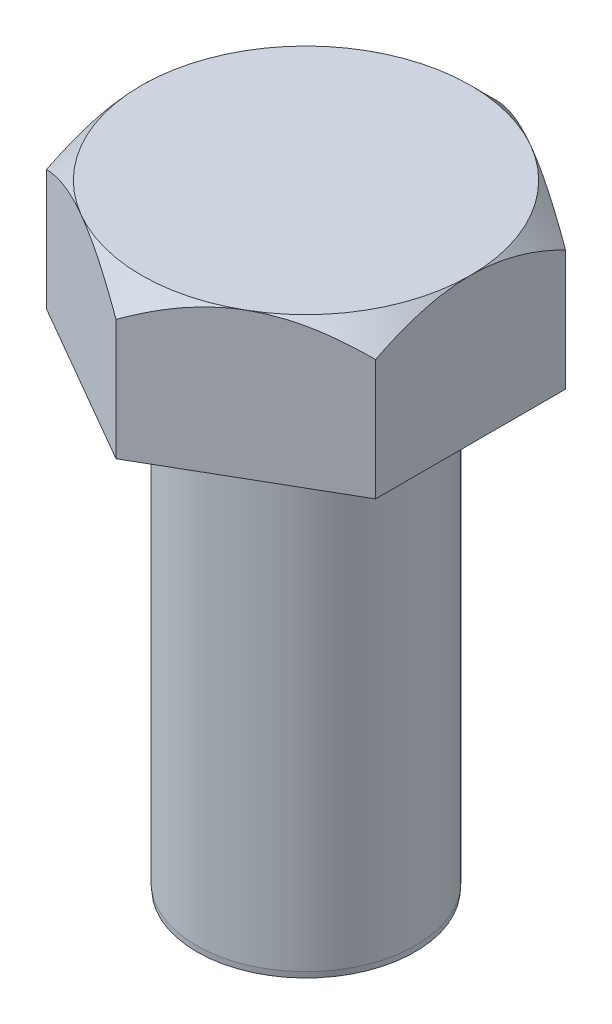
ISO-10303-21;
HEADER;
FILE_DESCRIPTION(('STEP AP214'),'2;1');
FILE_NAME('part.step','',(''),(''),'','','');
FILE_SCHEMA(('AUTOMOTIVE_DESIGN { 1 0 10303 214 1 1 1 1 }'));
ENDSEC;
DATA;
#1=APPLICATION_CONTEXT('core data for automotive mechanical design processes');
#2=APPLICATION_PROTOCOL_DEFINITION('international standard','automotive_design',2000,#1);
#3=PRODUCT_CONTEXT('',#1,'mechanical');
#4=PRODUCT('Part','Part','',(#3));
#5=PRODUCT_RELATED_PRODUCT_CATEGORY('part','',(#4));
#6=PRODUCT_DEFINITION_FORMATION('','',#4);
#7=PRODUCT_DEFINITION_CONTEXT('part definition',#1,'design');
#8=PRODUCT_DEFINITION('design','',#6,#7);
#9=PRODUCT_DEFINITION_SHAPE('','',#8);
#10=(LENGTH_UNIT() NAMED_UNIT(*) SI_UNIT(.MILLI.,.METRE.));
#11=(NAMED_UNIT(*) PLANE_ANGLE_UNIT() SI_UNIT($,.RADIAN.));
#12=(NAMED_UNIT(*) SI_UNIT($,.STERADIAN.) SOLID_ANGLE_UNIT());
#13=UNCERTAINTY_MEASURE_WITH_UNIT(LENGTH_MEASURE(1.E-05),#10,'distance_accuracy_value','');
#14=(GEOMETRIC_REPRESENTATION_CONTEXT(3) GLOBAL_UNCERTAINTY_ASSIGNED_CONTEXT((#13)) GLOBAL_UNIT_ASSIGNED_CONTEXT((#10,
#11,#12)) REPRESENTATION_CONTEXT('',''));
#15=CARTESIAN_POINT('',(0.,0.,0.));
#16=DIRECTION('',(0.,0.,1.));
#17=DIRECTION('',(1.,0.,0.));
#18=AXIS2_PLACEMENT_3D('',#15,#16,#17);
#19=CARTESIAN_POINT('',(7.15009999999996,6.35,-4.12811215973283));
#20=DIRECTION('',(-0.499999999999995,0.,0.866025403784441));
#21=DIRECTION('',(0.866025403784442,0.,0.499999999999995));
#22=AXIS2_PLACEMENT_3D('',#19,#20,#21);
#23=PLANE('',#22);
#24=CARTESIAN_POINT('',(7.15029999999996,5.24376020805829,-4.12799668967899));
#25=CARTESIAN_POINT('',(7.02735981479973,5.31473208114426,-4.19897623869856));
#26=CARTESIAN_POINT('',(6.90347465758507,5.38352591509957,-4.27050136756504));
#27=CARTESIAN_POINT('',(6.65362901516201,5.51609496244518,-4.41474981647385));
#28=CARTESIAN_POINT('',(6.52766744128796,5.57986743492815,-4.48747376505758));
#29=CARTESIAN_POINT('',(6.14521985336649,5.76320280111308,-4.70827998289497));
#30=CARTESIAN_POINT('',(5.88549626774101,5.87400155292641,-4.85823146497073));
#31=CARTESIAN_POINT('',(5.36174291484116,6.06373669034418,-5.16062060425642));
#32=CARTESIAN_POINT('',(5.09784700922402,6.14315107326227,-5.31298097640252));
#33=CARTESIAN_POINT('',(4.69766469893423,6.23501393674774,-5.54402634097325));
#34=CARTESIAN_POINT('',(4.56368142899528,6.26107948825729,-5.62138161793941));
#35=CARTESIAN_POINT('',(4.29458046497126,6.30353452510466,-5.77674713195786));
#36=CARTESIAN_POINT('',(4.15946294347778,6.319925456437,-5.85475726936435));
#37=CARTESIAN_POINT('',(3.83019852397778,6.34740730224126,-6.04485817059725));
#38=CARTESIAN_POINT('',(3.63569685436158,6.35317340265754,-6.15715376190799));
#39=CARTESIAN_POINT('',(3.24704409240871,6.34349459202812,-6.38154253864277));
#40=CARTESIAN_POINT('',(3.05289314684432,6.32804224579773,-6.49363563932778));
#41=CARTESIAN_POINT('',(2.66642169813378,6.27683739902505,-6.71676503427492));
#42=CARTESIAN_POINT('',(2.47410348685935,6.24106219749936,-6.82780000532428));
#43=CARTESIAN_POINT('',(2.09277255135678,6.15115660179108,-7.04796152358701));
#44=CARTESIAN_POINT('',(1.90375957482909,6.09702761510223,-7.15708821646561));
#45=CARTESIAN_POINT('',(1.56823093998172,5.98566881448239,-7.35080576411556));
#46=CARTESIAN_POINT('',(1.42097225552798,5.93136793728872,-7.43582560522543));
#47=CARTESIAN_POINT('',(1.12909829468736,5.81401595028394,-7.6043391150862));
#48=CARTESIAN_POINT('',(0.984483098549458,5.75096457532957,-7.68783273750533));
#49=CARTESIAN_POINT('',(0.6983516080155,5.61752492778284,-7.85303083058874));
#50=CARTESIAN_POINT('',(0.55682717595113,5.54715972840591,-7.93473999953801));
#51=CARTESIAN_POINT('',(0.276398890261677,5.40001620595466,-8.0966453457692));
#52=CARTESIAN_POINT('',(0.137493492810105,5.32324181558632,-8.17684241437976));
#53=CARTESIAN_POINT('',(-0.000199999999999894,5.24376020805829,-8.25633978951933));
#54=B_SPLINE_CURVE_WITH_KNOTS('',3,(#24,#25,#26,#27,#28,#29,#30,#31,#32,#33,#34,#35,#36,#37,#38,
#39,#40,#41,#42,#43,#44,#45,#46,#47,#48,#49,#50,#51,#52,#53),.UNSPECIFIED.,.F.,.F.,(4,2,2,2,2,2,
2,2,2,2,2,2,2,2,4),(0.,0.476107132166216,0.952472371030046,1.91034566100054,2.85300915505907,
3.32341643946382,3.7937533977268,4.46670173744884,5.13988594609707,5.81382359601269,
6.48770957546597,7.02295690652281,7.55822045931063,8.09184389327706,8.6251422671035),.UNSPECIFIED.);
#55=CARTESIAN_POINT('',(7.15009999999996,5.24387568053451,-4.12811215973283));
#56=VERTEX_POINT('',#55);
#57=CARTESIAN_POINT('',(3.57504999999996,6.35,-6.19216823959914));
#58=VERTEX_POINT('',#57);
#59=EDGE_CURVE('E105',#56,#58,#54,.T.);
#60=ORIENTED_EDGE('',*,*,#59,.F.);
#61=DIRECTION('',(0.,-1.,0.));
#62=VECTOR('',#61,1.);
#63=CARTESIAN_POINT('',(7.15009999999996,6.35,-4.12811215973283));
#64=LINE('',#63,#62);
#65=CARTESIAN_POINT('',(7.15009999999996,0.,-4.12811215973283));
#66=VERTEX_POINT('',#65);
#67=EDGE_CURVE('E266',#56,#66,#64,.T.);
#68=ORIENTED_EDGE('',*,*,#67,.T.);
#69=DIRECTION('',(-0.866025403784441,0.,-0.499999999999995));
#70=VECTOR('',#69,1.);
#71=CARTESIAN_POINT('',(7.15009999999996,0.,-4.12811215973283));
#72=LINE('',#71,#70);
#73=CARTESIAN_POINT('',(0.,0.,-8.25622431946549));
#74=VERTEX_POINT('',#73);
#75=EDGE_CURVE('E114',#66,#74,#72,.T.);
#76=ORIENTED_EDGE('',*,*,#75,.T.);
#77=DIRECTION('',(0.,-1.,0.));
#78=VECTOR('',#77,1.);
#79=CARTESIAN_POINT('',(0.,6.35,-8.25622431946549));
#80=LINE('',#79,#78);
#81=CARTESIAN_POINT('',(0.,5.24387568053451,-8.25622431946549));
#82=VERTEX_POINT('',#81);
#83=EDGE_CURVE('E132',#82,#74,#80,.T.);
#84=ORIENTED_EDGE('',*,*,#83,.F.);
#85=EDGE_CURVE('E115',#58,#82,#54,.T.);
#86=ORIENTED_EDGE('',*,*,#85,.F.);
#87=EDGE_LOOP('',(#60,#68,#76,#84,#86));
#88=FACE_BOUND('',#87,.T.);
#89=ADVANCED_FACE('F35',(#88),#23,.F.);
#90=CARTESIAN_POINT('',(0.,6.35,-8.25622431946549));
#91=DIRECTION('',(0.500000000000001,0.,0.866025403784438));
#92=DIRECTION('',(0.866025403784438,0.,-0.500000000000001));
#93=AXIS2_PLACEMENT_3D('',#90,#91,#92);
#94=PLANE('',#93);
#95=CARTESIAN_POINT('',(0.0002,5.24376020805829,-8.25633978951933));
#96=CARTESIAN_POINT('',(-0.122740185200222,5.31473208114426,-8.18536024049976));
#97=CARTESIAN_POINT('',(-0.246625342414885,5.38352591509958,-8.11383511163327));
#98=CARTESIAN_POINT('',(-0.496470984837945,5.51609496244519,-7.96958666272447));
#99=CARTESIAN_POINT('',(-0.622432558711996,5.57986743492816,-7.89686271414073));
#100=CARTESIAN_POINT('',(-1.00488014663348,5.76320280111309,-7.67605649630334));
#101=CARTESIAN_POINT('',(-1.26460373225895,5.87400155292642,-7.52610501422758));
#102=CARTESIAN_POINT('',(-1.78835708515881,6.06373669034419,-7.22371587494188));
#103=CARTESIAN_POINT('',(-2.05225299077595,6.1431510732623,-7.07135550279578));
#104=CARTESIAN_POINT('',(-2.45243530106574,6.23501393674777,-6.84031013822504));
#105=CARTESIAN_POINT('',(-2.58641857100469,6.26107948825732,-6.76295486125888));
#106=CARTESIAN_POINT('',(-2.85551953502872,6.30353452510469,-6.60758934724042));
#107=CARTESIAN_POINT('',(-2.99063705652219,6.31992545643702,-6.52957920983393));
#108=CARTESIAN_POINT('',(-3.3199014760222,6.34740730224129,-6.33947830860103));
#109=CARTESIAN_POINT('',(-3.51440314563839,6.35317340265757,-6.22718271729029));
#110=CARTESIAN_POINT('',(-3.90305590759126,6.34349459202815,-6.00279394055551));
#111=CARTESIAN_POINT('',(-4.09720685315564,6.32804224579776,-5.89070083987049));
#112=CARTESIAN_POINT('',(-4.48367830186619,6.27683739902508,-5.66757144492336));
#113=CARTESIAN_POINT('',(-4.67599651314062,6.24106219749939,-5.556536473874));
#114=CARTESIAN_POINT('',(-5.05732744864318,6.15115660179112,-5.33637495561126));
#115=CARTESIAN_POINT('',(-5.24634042517087,6.09702761510226,-5.22724826273266));
#116=CARTESIAN_POINT('',(-5.58186906001824,5.98566881448243,-5.03353071508271));
#117=CARTESIAN_POINT('',(-5.72912774447198,5.93136793728875,-4.94851087397283));
#118=CARTESIAN_POINT('',(-6.02100170531261,5.81401595028396,-4.77999736411205));
#119=CARTESIAN_POINT('',(-6.16561690145052,5.7509645753296,-4.69650374169292));
#120=CARTESIAN_POINT('',(-6.45174839198449,5.61752492778286,-4.5313056486095));
#121=CARTESIAN_POINT('',(-6.59327282404887,5.54715972840593,-4.44959647966022));
#122=CARTESIAN_POINT('',(-6.87370110973833,5.40001620595466,-4.28769113342903));
#123=CARTESIAN_POINT('',(-7.0126065071899,5.32324181558632,-4.20749406481847));
#124=CARTESIAN_POINT('',(-7.15030000000001,5.24376020805829,-4.12799668967889));
#125=B_SPLINE_CURVE_WITH_KNOTS('',3,(#95,#96,#97,#98,#99,#100,#101,#102,#103,#104,#105,#106,
#107,#108,#109,#110,#111,#112,#113,#114,#115,#116,#117,#118,#119,#120,#121,#122,#123,#124),
.UNSPECIFIED.,.F.,.F.,(4,2,2,2,2,2,2,2,2,2,2,2,2,2,4),(0.,0.476107132166221,0.952472371030056,
1.91034566100056,2.85300915505911,3.32341643946385,3.79375339772684,4.46670173744889,
5.13988594609711,5.81382359601273,6.48770957546601,7.02295690652286,7.55822045931071,
8.09184389327715,8.62514226710361),.UNSPECIFIED.);
#126=CARTESIAN_POINT('',(-3.57505000000001,6.35,-6.19216823959911));
#127=VERTEX_POINT('',#126);
#128=EDGE_CURVE('E122',#82,#127,#125,.T.);
#129=ORIENTED_EDGE('',*,*,#128,.F.);
#130=ORIENTED_EDGE('',*,*,#83,.T.);
#131=DIRECTION('',(-0.866025403784438,0.,0.500000000000001));
#132=VECTOR('',#131,1.);
#133=CARTESIAN_POINT('',(0.,0.,-8.25622431946549));
#134=LINE('',#133,#132);
#135=CARTESIAN_POINT('',(-7.15010000000001,0.,-4.12811215973273));
#136=VERTEX_POINT('',#135);
#137=EDGE_CURVE('E257',#74,#136,#134,.T.);
#138=ORIENTED_EDGE('',*,*,#137,.T.);
#139=DIRECTION('',(0.,-1.,0.));
#140=VECTOR('',#139,1.);
#141=CARTESIAN_POINT('',(-7.15010000000001,6.35,-4.12811215973273));
#142=LINE('',#141,#140);
#143=CARTESIAN_POINT('',(-7.15010000000001,5.24387568053451,-4.12811215973273));
#144=VERTEX_POINT('',#143);
#145=EDGE_CURVE('E199',#144,#136,#142,.T.);
#146=ORIENTED_EDGE('',*,*,#145,.F.);
#147=EDGE_CURVE('E133',#127,#144,#125,.T.);
#148=ORIENTED_EDGE('',*,*,#147,.F.);
#149=EDGE_LOOP('',(#129,#130,#138,#146,#148));
#150=FACE_BOUND('',#149,.T.);
#151=ADVANCED_FACE('F187',(#150),#94,.F.);
#152=CARTESIAN_POINT('',(-7.15010000000001,6.35,-4.12811215973273));
#153=DIRECTION('',(1.,0.,0.));
#154=DIRECTION('',(0.,0.,-1.));
#155=AXIS2_PLACEMENT_3D('',#152,#153,#154);
#156=PLANE('',#155);
#157=CARTESIAN_POINT('',(-7.15010000000003,1.63089085788719,-9.47386909605649));
#158=CARTESIAN_POINT('',(-7.15010000000003,1.81121581560539,-9.24790249070521));
#159=CARTESIAN_POINT('',(-7.15010000000003,1.99016418725543,-9.02082114931031));
#160=CARTESIAN_POINT('',(-7.15010000000003,2.34465316669975,-8.56394073706759));
#161=CARTESIAN_POINT('',(-7.15010000000003,2.5201930563962,-8.33414110959574));
#162=CARTESIAN_POINT('',(-7.15010000000003,2.868446395647,-7.86968034981608));
#163=CARTESIAN_POINT('',(-7.15010000000003,3.0411284373893,-7.63499559658916));
#164=CARTESIAN_POINT('',(-7.15010000000002,3.38131039804522,-7.16191403046406));
#165=CARTESIAN_POINT('',(-7.15010000000002,3.54881066036877,-6.92351746513816));
#166=CARTESIAN_POINT('',(-7.15010000000002,3.89019859321875,-6.42356671095031));
#167=CARTESIAN_POINT('',(-7.15010000000002,4.06356649358224,-6.16165586234294));
#168=CARTESIAN_POINT('',(-7.15010000000002,4.40077381694092,-5.63166319550724));
#169=CARTESIAN_POINT('',(-7.15010000000002,4.56461143837196,-5.36358022380933));
#170=CARTESIAN_POINT('',(-7.15010000000002,4.87937516438839,-4.82096243326766));
#171=CARTESIAN_POINT('',(-7.15010000000002,5.03033869234989,-4.54644949317194));
#172=CARTESIAN_POINT('',(-7.15010000000001,5.31597281014485,-3.98913965325442));
#173=CARTESIAN_POINT('',(-7.15010000000001,5.45065169434768,-3.70634706251455));
#174=CARTESIAN_POINT('',(-7.15010000000001,5.68224395499392,-3.16946720873966));
#175=CARTESIAN_POINT('',(-7.15010000000001,5.78179628197522,-2.91652981738955));
#176=CARTESIAN_POINT('',(-7.15010000000001,5.96068130805078,-2.40346766112692));
#177=CARTESIAN_POINT('',(-7.15010000000001,6.04001286165642,-2.14334248995796));
#178=CARTESIAN_POINT('',(-7.1501,6.17245096820923,-1.62248495464225));
#179=CARTESIAN_POINT('',(-7.1501,6.22609680418521,-1.36189223637387));
#180=CARTESIAN_POINT('',(-7.1501,6.30590762943054,-0.836507861915944));
#181=CARTESIAN_POINT('',(-7.1501,6.33208104018206,-0.571717517759924));
#182=CARTESIAN_POINT('',(-7.1501,6.35408284405149,-0.0577187353176461));
#183=CARTESIAN_POINT('',(-7.1501,6.35173239837544,0.19141159314656));
#184=CARTESIAN_POINT('',(-7.1501,6.32124800606946,0.688077635906895));
#185=CARTESIAN_POINT('',(-7.1501,6.29311214694111,0.935613230550542));
#186=CARTESIAN_POINT('',(-7.15009999999999,6.21229082442829,1.43154670462864));
#187=CARTESIAN_POINT('',(-7.15009999999999,6.15913527095504,1.6798664946589));
#188=CARTESIAN_POINT('',(-7.15009999999999,6.03147971556139,2.17085918647798));
#189=CARTESIAN_POINT('',(-7.15009999999999,5.9569795257941,2.4135320385497));
#190=CARTESIAN_POINT('',(-7.15009999999999,5.79048248965085,2.89215321636684));
#191=CARTESIAN_POINT('',(-7.15009999999999,5.69852189244993,3.12811432942166));
#192=CARTESIAN_POINT('',(-7.15009999999999,5.50032506783947,3.59401612680425));
#193=CARTESIAN_POINT('',(-7.15009999999999,5.39408271156479,3.8239541754974));
#194=CARTESIAN_POINT('',(-7.15009999999998,5.16984050461004,4.27885242834733));
#195=CARTESIAN_POINT('',(-7.15009999999998,5.05180562125056,4.50379521875785));
#196=CARTESIAN_POINT('',(-7.15009999999998,4.80656023664318,4.94854616944678));
#197=CARTESIAN_POINT('',(-7.15009999999998,4.67935108776111,5.168355080205));
#198=CARTESIAN_POINT('',(-7.15009999999998,4.42401096856745,5.59273981639913));
#199=CARTESIAN_POINT('',(-7.15009999999998,4.29623669089792,5.79753139755686));
#200=CARTESIAN_POINT('',(-7.15009999999998,4.03519862932643,6.20359582585859));
#201=CARTESIAN_POINT('',(-7.15009999999998,3.90193444245225,6.4048684131501));
#202=CARTESIAN_POINT('',(-7.15009999999998,3.63195773249821,6.80275896707806));
#203=CARTESIAN_POINT('',(-7.15009999999998,3.49528075722348,6.9994011408559));
#204=CARTESIAN_POINT('',(-7.15009999999997,3.21822330604325,7.38998078224734));
#205=CARTESIAN_POINT('',(-7.15009999999997,3.0778438588743,7.58391897874123));
#206=CARTESIAN_POINT('',(-7.15009999999997,2.93594735354651,7.77672110388246));
#207=B_SPLINE_CURVE_WITH_KNOTS('',3,(#157,#158,#159,#160,#161,#162,#163,#164,#165,#166,#167,
#168,#169,#170,#171,#172,#173,#174,#175,#176,#177,#178,#179,#180,#181,#182,#183,#184,#185,#186,
#187,#188,#189,#190,#191,#192,#193,#194,#195,#196,#197,#198,#199,#200,#201,#202,#203,#204,#205,
#206),.UNSPECIFIED.,.F.,.F.,(4,2,2,2,2,2,2,2,2,2,2,2,2,2,2,2,2,2,2,2,2,2,2,2,4),(0.,
0.867309176171177,1.73479913643537,2.60884845848508,3.48283973039317,4.42495432930787,
5.36724644671029,6.30669878036595,7.24567058249782,8.06046150623437,8.87529857688988,
9.67218308312768,10.4688232385201,11.214882925787,11.9609979526155,12.7217281313764,
13.4824650052708,14.2416394652586,15.0011407631884,15.7629695239043,16.524686213128,
17.248733545678,17.9728341200296,18.6912157430264,19.4093998229271),.UNSPECIFIED.);
#208=CARTESIAN_POINT('',(-7.1501,6.35,0.));
#209=VERTEX_POINT('',#208);
#210=EDGE_CURVE('E181',#144,#209,#207,.T.);
#211=ORIENTED_EDGE('',*,*,#210,.F.);
#212=ORIENTED_EDGE('',*,*,#145,.T.);
#213=DIRECTION('',(0.,0.,1.));
#214=VECTOR('',#213,1.);
#215=CARTESIAN_POINT('',(-7.15010000000001,0.,-4.12811215973273));
#216=LINE('',#215,#214);
#217=CARTESIAN_POINT('',(-7.15009999999999,0.,4.12811215973278));
#218=VERTEX_POINT('',#217);
#219=EDGE_CURVE('E216',#136,#218,#216,.T.);
#220=ORIENTED_EDGE('',*,*,#219,.T.);
#221=DIRECTION('',(0.,-1.,0.));
#222=VECTOR('',#221,1.);
#223=CARTESIAN_POINT('',(-7.15009999999999,6.35,4.12811215973278));
#224=LINE('',#223,#222);
#225=CARTESIAN_POINT('',(-7.15009999999999,5.24387568053451,4.12811215973278));
#226=VERTEX_POINT('',#225);
#227=EDGE_CURVE('E214',#226,#218,#224,.T.);
#228=ORIENTED_EDGE('',*,*,#227,.F.);
#229=EDGE_CURVE('E176',#209,#226,#207,.T.);
#230=ORIENTED_EDGE('',*,*,#229,.F.);
#231=EDGE_LOOP('',(#211,#212,#220,#228,#230));
#232=FACE_BOUND('',#231,.T.);
#233=ADVANCED_FACE('F183',(#232),#156,.F.);
#234=CARTESIAN_POINT('',(-7.15009999999999,6.35,4.12811215973278));
#235=DIRECTION('',(0.499999999999995,0.,-0.866025403784441));
#236=DIRECTION('',(-0.866025403784441,0.,-0.499999999999995));
#237=AXIS2_PLACEMENT_3D('',#234,#235,#236);
#238=PLANE('',#237);
#239=CARTESIAN_POINT('',(-7.15029999999998,5.24376020805829,4.12799668967894));
#240=CARTESIAN_POINT('',(-7.02735981479976,5.31473208114426,4.19897623869851));
#241=CARTESIAN_POINT('',(-6.9034746575851,5.38352591509958,4.27050136756499));
#242=CARTESIAN_POINT('',(-6.65362901516204,5.51609496244519,4.4147498164738));
#243=CARTESIAN_POINT('',(-6.52766744128798,5.57986743492816,4.48747376505753));
#244=CARTESIAN_POINT('',(-6.1452198533665,5.76320280111309,4.70827998289492));
#245=CARTESIAN_POINT('',(-5.88549626774103,5.87400155292642,4.85823146497068));
#246=CARTESIAN_POINT('',(-5.36174291484117,6.06373669034419,5.16062060425638));
#247=CARTESIAN_POINT('',(-5.09784700922402,6.1431510732623,5.31298097640248));
#248=CARTESIAN_POINT('',(-4.69766469893423,6.23501393674777,5.54402634097321));
#249=CARTESIAN_POINT('',(-4.56368142899528,6.26107948825732,5.62138161793937));
#250=CARTESIAN_POINT('',(-4.29458046497126,6.30353452510469,5.77674713195783));
#251=CARTESIAN_POINT('',(-4.15946294347778,6.31992545643702,5.85475726936432));
#252=CARTESIAN_POINT('',(-3.83019852397777,6.34740730224129,6.04485817059721));
#253=CARTESIAN_POINT('',(-3.63569685436158,6.35317340265757,6.15715376190795));
#254=CARTESIAN_POINT('',(-3.24704409240871,6.34349459202815,6.38154253864273));
#255=CARTESIAN_POINT('',(-3.05289314684433,6.32804224579776,6.49363563932775));
#256=CARTESIAN_POINT('',(-2.66642169813378,6.27683739902508,6.71676503427488));
#257=CARTESIAN_POINT('',(-2.47410348685935,6.24106219749939,6.82780000532424));
#258=CARTESIAN_POINT('',(-2.09277255135678,6.15115660179112,7.04796152358698));
#259=CARTESIAN_POINT('',(-1.90375957482909,6.09702761510226,7.15708821646557));
#260=CARTESIAN_POINT('',(-1.56823093998172,5.98566881448243,7.35080576411552));
#261=CARTESIAN_POINT('',(-1.42097225552798,5.93136793728875,7.4358256052254));
#262=CARTESIAN_POINT('',(-1.12909829468735,5.81401595028396,7.60433911508618));
#263=CARTESIAN_POINT('',(-0.984483098549436,5.7509645753296,7.68783273750531));
#264=CARTESIAN_POINT('',(-0.698351608015466,5.61752492778286,7.85303083058873));
#265=CARTESIAN_POINT('',(-0.556827175951092,5.54715972840593,7.934739999538));
#266=CARTESIAN_POINT('',(-0.276398890261629,5.40001620595466,8.0966453457692));
#267=CARTESIAN_POINT('',(-0.137493492810052,5.32324181558632,8.17684241437975));
#268=CARTESIAN_POINT('',(0.000200000000057124,5.24376020805829,8.25633978951933));
#269=B_SPLINE_CURVE_WITH_KNOTS('',3,(#239,#240,#241,#242,#243,#244,#245,#246,#247,#248,#249,
#250,#251,#252,#253,#254,#255,#256,#257,#258,#259,#260,#261,#262,#263,#264,#265,#266,#267,#268),
.UNSPECIFIED.,.F.,.F.,(4,2,2,2,2,2,2,2,2,2,2,2,2,2,4),(0.,0.476107132166221,0.952472371030058,
1.91034566100057,2.85300915505911,3.32341643946385,3.79375339772684,4.46670173744888,
5.13988594609711,5.81382359601273,6.48770957546601,7.02295690652286,7.55822045931071,
8.09184389327715,8.62514226710361),.UNSPECIFIED.);
#270=CARTESIAN_POINT('',(-3.57504999999996,6.35,6.19216823959913));
#271=VERTEX_POINT('',#270);
#272=EDGE_CURVE('E182',#226,#271,#269,.T.);
#273=ORIENTED_EDGE('',*,*,#272,.F.);
#274=ORIENTED_EDGE('',*,*,#227,.T.);
#275=DIRECTION('',(0.866025403784441,0.,0.499999999999995));
#276=VECTOR('',#275,1.);
#277=CARTESIAN_POINT('',(-7.15009999999999,0.,4.12811215973278));
#278=LINE('',#277,#276);
#279=CARTESIAN_POINT('',(0.,0.,8.25622431946549));
#280=VERTEX_POINT('',#279);
#281=EDGE_CURVE('E258',#218,#280,#278,.T.);
#282=ORIENTED_EDGE('',*,*,#281,.T.);
#283=DIRECTION('',(0.,-1.,0.));
#284=VECTOR('',#283,1.);
#285=CARTESIAN_POINT('',(0.,6.35,8.25622431946549));
#286=LINE('',#285,#284);
#287=CARTESIAN_POINT('',(0.,5.24387568053451,8.25622431946549));
#288=VERTEX_POINT('',#287);
#289=EDGE_CURVE('E220',#288,#280,#286,.T.);
#290=ORIENTED_EDGE('',*,*,#289,.F.);
#291=EDGE_CURVE('E171',#271,#288,#269,.T.);
#292=ORIENTED_EDGE('',*,*,#291,.F.);
#293=EDGE_LOOP('',(#273,#274,#282,#290,#292));
#294=FACE_BOUND('',#293,.T.);
#295=ADVANCED_FACE('F186',(#294),#238,.F.);
#296=CARTESIAN_POINT('',(0.,6.35,8.25622431946549));
#297=DIRECTION('',(-0.500000000000007,0.,-0.866025403784435));
#298=DIRECTION('',(-0.866025403784435,0.,0.500000000000007));
#299=AXIS2_PLACEMENT_3D('',#296,#297,#298);
#300=PLANE('',#299);
#301=CARTESIAN_POINT('',(-0.000199999999942347,5.24376020805829,8.25633978951933));
#302=CARTESIAN_POINT('',(0.122740185200279,5.31473208114426,8.18536024049976));
#303=CARTESIAN_POINT('',(0.246625342414941,5.38352591509958,8.11383511163327));
#304=CARTESIAN_POINT('',(0.496470984838001,5.51609496244519,7.96958666272446));
#305=CARTESIAN_POINT('',(0.622432558712051,5.57986743492816,7.89686271414073));
#306=CARTESIAN_POINT('',(1.00488014663353,5.76320280111309,7.67605649630334));
#307=CARTESIAN_POINT('',(1.264603732259,5.87400155292642,7.52610501422757));
#308=CARTESIAN_POINT('',(1.78835708515886,6.06373669034419,7.22371587494186));
#309=CARTESIAN_POINT('',(2.052252990776,6.1431510732623,7.07135550279576));
#310=CARTESIAN_POINT('',(2.45243530106579,6.23501393674777,6.84031013822502));
#311=CARTESIAN_POINT('',(2.58641857100474,6.26107948825731,6.76295486125886));
#312=CARTESIAN_POINT('',(2.85551953502876,6.30353452510469,6.6075893472404));
#313=CARTESIAN_POINT('',(2.99063705652223,6.31992545643702,6.52957920983391));
#314=CARTESIAN_POINT('',(3.31990147602224,6.34740730224129,6.33947830860101));
#315=CARTESIAN_POINT('',(3.51440314563843,6.35317340265757,6.22718271729027));
#316=CARTESIAN_POINT('',(3.9030559075913,6.34349459202815,6.00279394055549));
#317=CARTESIAN_POINT('',(4.09720685315568,6.32804224579776,5.89070083987047));
#318=CARTESIAN_POINT('',(4.48367830186623,6.27683739902508,5.66757144492333));
#319=CARTESIAN_POINT('',(4.67599651314065,6.24106219749939,5.55653647387397));
#320=CARTESIAN_POINT('',(5.05732744864322,6.15115660179112,5.33637495561122));
#321=CARTESIAN_POINT('',(5.24634042517091,6.09702761510226,5.22724826273263));
#322=CARTESIAN_POINT('',(5.58186906001828,5.98566881448243,5.03353071508267));
#323=CARTESIAN_POINT('',(5.72912774447202,5.93136793728875,4.94851087397279));
#324=CARTESIAN_POINT('',(6.02100170531265,5.81401595028396,4.77999736411201));
#325=CARTESIAN_POINT('',(6.16561690145056,5.7509645753296,4.69650374169287));
#326=CARTESIAN_POINT('',(6.45174839198452,5.61752492778285,4.53130564860946));
#327=CARTESIAN_POINT('',(6.5932728240489,5.54715972840592,4.44959647966018));
#328=CARTESIAN_POINT('',(6.87370110973836,5.40001620595466,4.28769113342898));
#329=CARTESIAN_POINT('',(7.01260650718993,5.32324181558632,4.20749406481842));
#330=CARTESIAN_POINT('',(7.15030000000004,5.24376020805829,4.12799668967884));
#331=B_SPLINE_CURVE_WITH_KNOTS('',3,(#301,#302,#303,#304,#305,#306,#307,#308,#309,#310,#311,
#312,#313,#314,#315,#316,#317,#318,#319,#320,#321,#322,#323,#324,#325,#326,#327,#328,#329,#330),
.UNSPECIFIED.,.F.,.F.,(4,2,2,2,2,2,2,2,2,2,2,2,2,2,4),(0.,0.476107132166222,0.952472371030056,
1.91034566100056,2.8530091550591,3.32341643946385,3.79375339772684,4.46670173744888,
5.13988594609711,5.81382359601273,6.48770957546601,7.02295690652286,7.55822045931071,
8.09184389327715,8.62514226710361),.UNSPECIFIED.);
#332=CARTESIAN_POINT('',(3.57505000000005,6.35,6.19216823959909));
#333=VERTEX_POINT('',#332);
#334=EDGE_CURVE('E277',#288,#333,#331,.T.);
#335=ORIENTED_EDGE('',*,*,#334,.F.);
#336=ORIENTED_EDGE('',*,*,#289,.T.);
#337=DIRECTION('',(0.866025403784435,0.,-0.500000000000007));
#338=VECTOR('',#337,1.);
#339=CARTESIAN_POINT('',(0.,0.,8.25622431946549));
#340=LINE('',#339,#338);
#341=CARTESIAN_POINT('',(7.15010000000004,0.,4.12811215973268));
#342=VERTEX_POINT('',#341);
#343=EDGE_CURVE('E262',#280,#342,#340,.T.);
#344=ORIENTED_EDGE('',*,*,#343,.T.);
#345=DIRECTION('',(0.,-1.,0.));
#346=VECTOR('',#345,1.);
#347=CARTESIAN_POINT('',(7.15010000000004,6.35,4.12811215973268));
#348=LINE('',#347,#346);
#349=CARTESIAN_POINT('',(7.15010000000004,5.24387568053451,4.12811215973268));
#350=VERTEX_POINT('',#349);
#351=EDGE_CURVE('E223',#350,#342,#348,.T.);
#352=ORIENTED_EDGE('',*,*,#351,.F.);
#353=EDGE_CURVE('E165',#333,#350,#331,.T.);
#354=ORIENTED_EDGE('',*,*,#353,.F.);
#355=EDGE_LOOP('',(#335,#336,#344,#352,#354));
#356=FACE_BOUND('',#355,.T.);
#357=ADVANCED_FACE('F274',(#356),#300,.F.);
#358=CARTESIAN_POINT('',(7.15010000000004,6.35,4.12811215973268));
#359=DIRECTION('',(-1.,0.,0.));
#360=DIRECTION('',(0.,0.,1.));
#361=AXIS2_PLACEMENT_3D('',#358,#359,#360);
#362=PLANE('',#361);
#363=CARTESIAN_POINT('',(7.1500999999999,1.63089084568141,-9.47386911134843));
#364=CARTESIAN_POINT('',(7.1500999999999,1.8112158038748,-9.24790250553399));
#365=CARTESIAN_POINT('',(7.15009999999991,1.9901641759994,-9.02082116367475));
#366=CARTESIAN_POINT('',(7.15009999999991,2.34465315639033,-8.56394075049952));
#367=CARTESIAN_POINT('',(7.15009999999991,2.52019304655884,-8.33414112255949));
#368=CARTESIAN_POINT('',(7.15009999999992,2.86844638675769,-7.86968036182892));
#369=CARTESIAN_POINT('',(7.15009999999992,3.04112842897584,-7.63499560811917));
#370=CARTESIAN_POINT('',(7.15009999999992,3.38131039057672,-7.16191404102097));
#371=CARTESIAN_POINT('',(7.15009999999993,3.54881065336935,-6.92351747520483));
#372=CARTESIAN_POINT('',(7.15009999999993,3.89019858720553,-6.42356671995492));
#373=CARTESIAN_POINT('',(7.15009999999994,4.06356648808435,-6.16165587077427));
#374=CARTESIAN_POINT('',(7.15009999999994,4.40077381245204,-5.63166320277258));
#375=CARTESIAN_POINT('',(7.15009999999994,4.56461143437675,-5.36358023048195));
#376=CARTESIAN_POINT('',(7.15009999999995,4.87937516134173,-4.82096243873408));
#377=CARTESIAN_POINT('',(7.15009999999995,5.03033868975839,-4.54644949802505));
#378=CARTESIAN_POINT('',(7.15009999999996,5.31597280840798,-3.98913965684663));
#379=CARTESIAN_POINT('',(7.15009999999996,5.45065169301035,-3.7063470654592));
#380=CARTESIAN_POINT('',(7.15009999999997,5.68224395389446,-3.16946721142345));
#381=CARTESIAN_POINT('',(7.15009999999997,5.7817962807887,-2.91652982049303));
#382=CARTESIAN_POINT('',(7.15009999999997,5.96068130677324,-2.40346766509055));
#383=CARTESIAN_POINT('',(7.15009999999998,6.04001286037489,-2.14334249436203));
#384=CARTESIAN_POINT('',(7.15009999999998,6.17245096702639,-1.62248495991549));
#385=CARTESIAN_POINT('',(7.15009999999999,6.22609680310152,-1.36189224207524));
#386=CARTESIAN_POINT('',(7.15009999999999,6.30590762865255,-0.836507868466953));
#387=CARTESIAN_POINT('',(7.15009999999999,6.33208103961055,-0.571717524732427));
#388=CARTESIAN_POINT('',(7.1501,6.35408284398224,-0.057718742911977));
#389=CARTESIAN_POINT('',(7.1501,6.35173239857837,0.191411585350977));
#390=CARTESIAN_POINT('',(7.15010000000001,6.32124800684642,0.688077627739453));
#391=CARTESIAN_POINT('',(7.15010000000001,6.29311214801996,0.935613222212498));
#392=CARTESIAN_POINT('',(7.15010000000001,6.2122908261277,1.43154669595436));
#393=CARTESIAN_POINT('',(7.15010000000002,6.15913527297532,1.67986648581989));
#394=CARTESIAN_POINT('',(7.15010000000002,6.03147971821725,2.17085917733268));
#395=CARTESIAN_POINT('',(7.15010000000002,5.95697952876465,2.41353202926283));
#396=CARTESIAN_POINT('',(7.15010000000003,5.79048249349503,2.89215320606262));
#397=CARTESIAN_POINT('',(7.15010000000003,5.69852189690814,3.12811431826103));
#398=CARTESIAN_POINT('',(7.15010000000004,5.50032507358712,3.59401611397431));
#399=CARTESIAN_POINT('',(7.15010000000004,5.39408271798793,3.82395416185457));
#400=CARTESIAN_POINT('',(7.15010000000004,5.16984051242519,4.27885241310805));
#401=CARTESIAN_POINT('',(7.15010000000005,5.05180562978249,4.50379520273518));
#402=CARTESIAN_POINT('',(7.15010000000005,4.80656024663132,4.94854615188308));
#403=CARTESIAN_POINT('',(7.15010000000005,4.67935109848869,5.16835506188367));
#404=CARTESIAN_POINT('',(7.15010000000006,4.42401098069604,5.59273979670796));
#405=CARTESIAN_POINT('',(7.15010000000006,4.29623670368454,5.79753137725083));
#406=CARTESIAN_POINT('',(7.15010000000007,4.03519864343176,6.20359580433172));
#407=CARTESIAN_POINT('',(7.15010000000007,3.90193445721827,6.40486839101724));
#408=CARTESIAN_POINT('',(7.15010000000007,3.63195774857802,6.80275894374802));
#409=CARTESIAN_POINT('',(7.15010000000007,3.49528077395631,6.99940111693457));
#410=CARTESIAN_POINT('',(7.15010000000008,3.21822332408119,7.38998075714733));
#411=CARTESIAN_POINT('',(7.15010000000008,3.07784387756432,7.58391895305384));
#412=CARTESIAN_POINT('',(7.15010000000008,2.93594737288767,7.7767210776087));
#413=B_SPLINE_CURVE_WITH_KNOTS('',3,(#363,#364,#365,#366,#367,#368,#369,#370,#371,#372,#373,
#374,#375,#376,#377,#378,#379,#380,#381,#382,#383,#384,#385,#386,#387,#388,#389,#390,#391,#392,
#393,#394,#395,#396,#397,#398,#399,#400,#401,#402,#403,#404,#405,#406,#407,#408,#409,#410,#411,
#412),.UNSPECIFIED.,.F.,.F.,(4,2,2,2,2,2,2,2,2,2,2,2,2,2,2,2,2,2,2,2,2,2,2,2,4),(0.,
0.867309178146457,1.7347991403865,2.60884846444894,3.4828397383694,4.42495433957124,
5.36724645926233,6.30669879518682,7.24567059958342,8.06046152205712,8.87529859145194,
9.67218309649984,10.468823250704,11.2148829373626,11.9609979635813,12.7217281416573,
13.4824650148672,14.2416394717964,15.001140766664,15.7629695243005,16.524686210446,
17.248733540386,17.9728341121274,18.6912157325493,19.4093998098754),.UNSPECIFIED.);
#414=CARTESIAN_POINT('',(7.1501,6.35,0.));
#415=VERTEX_POINT('',#414);
#416=EDGE_CURVE('E270',#350,#415,#413,.F.);
#417=ORIENTED_EDGE('',*,*,#416,.F.);
#418=ORIENTED_EDGE('',*,*,#351,.T.);
#419=DIRECTION('',(0.,0.,-1.));
#420=VECTOR('',#419,1.);
#421=CARTESIAN_POINT('',(7.15010000000004,0.,4.12811215973268));
#422=LINE('',#421,#420);
#423=EDGE_CURVE('E256',#342,#66,#422,.T.);
#424=ORIENTED_EDGE('',*,*,#423,.T.);
#425=ORIENTED_EDGE('',*,*,#67,.F.);
#426=EDGE_CURVE('E110',#415,#56,#413,.F.);
#427=ORIENTED_EDGE('',*,*,#426,.F.);
#428=EDGE_LOOP('',(#417,#418,#424,#425,#427));
#429=FACE_BOUND('',#428,.T.);
#430=ADVANCED_FACE('F250',(#429),#362,.F.);
#431=CARTESIAN_POINT('',(0.,0.,0.));
#432=DIRECTION('',(0.,1.,0.));
#433=DIRECTION('',(0.,0.,1.));
#434=AXIS2_PLACEMENT_3D('',#431,#432,#433);
#435=PLANE('',#434);
#436=CARTESIAN_POINT('',(0.,0.,0.));
#437=DIRECTION('',(0.,1.,0.));
#438=DIRECTION('',(0.,0.,1.));
#439=AXIS2_PLACEMENT_3D('',#436,#437,#438);
#440=CIRCLE('',#439,4.7625);
#441=CARTESIAN_POINT('',(0.,0.,4.7625));
#442=VERTEX_POINT('',#441);
#443=EDGE_CURVE('E228',#442,#442,#440,.F.);
#444=ORIENTED_EDGE('',*,*,#443,.F.);
#445=EDGE_LOOP('',(#444));
#446=FACE_BOUND('',#445,.T.);
#447=ORIENTED_EDGE('',*,*,#75,.F.);
#448=ORIENTED_EDGE('',*,*,#423,.F.);
#449=ORIENTED_EDGE('',*,*,#343,.F.);
#450=ORIENTED_EDGE('',*,*,#281,.F.);
#451=ORIENTED_EDGE('',*,*,#219,.F.);
#452=ORIENTED_EDGE('',*,*,#137,.F.);
#453=EDGE_LOOP('',(#447,#448,#449,#450,#451,#452));
#454=FACE_BOUND('',#453,.T.);
#455=ADVANCED_FACE('F245',(#446,#454),#435,.F.);
#456=CARTESIAN_POINT('',(0.,-20.32,0.));
#457=DIRECTION('',(0.,1.,0.));
#458=DIRECTION('',(0.,0.,1.));
#459=AXIS2_PLACEMENT_3D('',#456,#457,#458);
#460=CYLINDRICAL_SURFACE('',#459,4.7625);
#461=CARTESIAN_POINT('',(0.,-20.0660000000002,0.));
#462=DIRECTION('',(0.,-1.,0.));
#463=DIRECTION('',(0.,0.,-1.));
#464=AXIS2_PLACEMENT_3D('',#461,#462,#463);
#465=CIRCLE('',#464,4.7625);
#466=CARTESIAN_POINT('',(0.,-20.0660000000002,-4.7625));
#467=VERTEX_POINT('',#466);
#468=EDGE_CURVE('E12',#467,#467,#465,.F.);
#469=ORIENTED_EDGE('',*,*,#468,.T.);
#470=EDGE_LOOP('',(#469));
#471=FACE_BOUND('',#470,.T.);
#472=ORIENTED_EDGE('',*,*,#443,.T.);
#473=EDGE_LOOP('',(#472));
#474=FACE_BOUND('',#473,.T.);
#475=ADVANCED_FACE('F242',(#471,#474),#460,.T.);
#476=CARTESIAN_POINT('',(0.,-20.32,0.));
#477=DIRECTION('',(0.,-1.,0.));
#478=DIRECTION('',(0.,0.,-1.));
#479=AXIS2_PLACEMENT_3D('',#476,#477,#478);
#480=PLANE('',#479);
#481=CARTESIAN_POINT('',(0.,-20.32,0.));
#482=DIRECTION('',(0.,-1.,0.));
#483=DIRECTION('',(0.,0.,-1.));
#484=AXIS2_PLACEMENT_3D('',#481,#482,#483);
#485=CIRCLE('',#484,4.74027787946443);
#486=CARTESIAN_POINT('',(0.,-20.32,-4.74027787946443));
#487=VERTEX_POINT('',#486);
#488=EDGE_CURVE('E43',#487,#487,#485,.T.);
#489=ORIENTED_EDGE('',*,*,#488,.T.);
#490=EDGE_LOOP('',(#489));
#491=FACE_BOUND('',#490,.T.);
#492=ADVANCED_FACE('F151',(#491),#480,.T.);
#493=CARTESIAN_POINT('',(0.,6.35,0.));
#494=DIRECTION('',(0.,-1.,0.));
#495=DIRECTION('',(0.,0.,1.));
#496=AXIS2_PLACEMENT_3D('',#493,#494,#495);
#497=CONICAL_SURFACE('',#496,7.1501,0.78539816339745);
#498=ORIENTED_EDGE('',*,*,#291,.T.);
#499=ORIENTED_EDGE('',*,*,#334,.T.);
#500=CARTESIAN_POINT('',(0.,6.35,0.));
#501=DIRECTION('',(0.,1.,0.));
#502=DIRECTION('',(0.,0.,1.));
#503=AXIS2_PLACEMENT_3D('',#500,#501,#502);
#504=CIRCLE('',#503,7.1501);
#505=EDGE_CURVE('E129',#271,#333,#504,.T.);
#506=ORIENTED_EDGE('',*,*,#505,.F.);
#507=EDGE_LOOP('',(#498,#499,#506));
#508=FACE_BOUND('',#507,.T.);
#509=ADVANCED_FACE('F279',(#508),#497,.T.);
#510=ORIENTED_EDGE('',*,*,#229,.T.);
#511=ORIENTED_EDGE('',*,*,#272,.T.);
#512=EDGE_CURVE('E207',#209,#271,#504,.T.);
#513=ORIENTED_EDGE('',*,*,#512,.F.);
#514=EDGE_LOOP('',(#510,#511,#513));
#515=FACE_BOUND('',#514,.T.);
#516=ADVANCED_FACE('F208',(#515),#497,.T.);
#517=ORIENTED_EDGE('',*,*,#147,.T.);
#518=ORIENTED_EDGE('',*,*,#210,.T.);
#519=EDGE_CURVE('E126',#127,#209,#504,.T.);
#520=ORIENTED_EDGE('',*,*,#519,.F.);
#521=EDGE_LOOP('',(#517,#518,#520));
#522=FACE_BOUND('',#521,.T.);
#523=ADVANCED_FACE('F203',(#522),#497,.T.);
#524=ORIENTED_EDGE('',*,*,#85,.T.);
#525=ORIENTED_EDGE('',*,*,#128,.T.);
#526=EDGE_CURVE('E119',#58,#127,#504,.T.);
#527=ORIENTED_EDGE('',*,*,#526,.F.);
#528=EDGE_LOOP('',(#524,#525,#527));
#529=FACE_BOUND('',#528,.T.);
#530=ADVANCED_FACE('F120',(#529),#497,.T.);
#531=ORIENTED_EDGE('',*,*,#59,.T.);
#532=EDGE_CURVE('E108',#415,#58,#504,.T.);
#533=ORIENTED_EDGE('',*,*,#532,.F.);
#534=ORIENTED_EDGE('',*,*,#426,.T.);
#535=EDGE_LOOP('',(#531,#533,#534));
#536=FACE_BOUND('',#535,.T.);
#537=ADVANCED_FACE('F107',(#536),#497,.T.);
#538=ORIENTED_EDGE('',*,*,#353,.T.);
#539=ORIENTED_EDGE('',*,*,#416,.T.);
#540=CARTESIAN_POINT('',(0.,6.35,0.));
#541=DIRECTION('',(0.,1.,0.));
#542=DIRECTION('',(0.,0.,1.));
#543=AXIS2_PLACEMENT_3D('',#540,#541,#542);
#544=CIRCLE('',#543,7.1501);
#545=EDGE_CURVE('E50',#333,#415,#544,.T.);
#546=ORIENTED_EDGE('',*,*,#545,.F.);
#547=EDGE_LOOP('',(#538,#539,#546));
#548=FACE_BOUND('',#547,.T.);
#549=ADVANCED_FACE('F150',(#548),#497,.T.);
#550=CARTESIAN_POINT('',(0.,6.35,0.));
#551=DIRECTION('',(0.,1.,0.));
#552=DIRECTION('',(0.,0.,1.));
#553=AXIS2_PLACEMENT_3D('',#550,#551,#552);
#554=PLANE('',#553);
#555=ORIENTED_EDGE('',*,*,#505,.T.);
#556=ORIENTED_EDGE('',*,*,#545,.T.);
#557=ORIENTED_EDGE('',*,*,#532,.T.);
#558=ORIENTED_EDGE('',*,*,#526,.T.);
#559=ORIENTED_EDGE('',*,*,#519,.T.);
#560=ORIENTED_EDGE('',*,*,#512,.T.);
#561=EDGE_LOOP('',(#555,#556,#557,#558,#559,#560));
#562=FACE_BOUND('',#561,.T.);
#563=ADVANCED_FACE('F128',(#562),#554,.T.);
#564=CARTESIAN_POINT('',(0.,-20.32,0.));
#565=DIRECTION('',(0.,1.,0.));
#566=DIRECTION('',(0.,0.,1.));
#567=AXIS2_PLACEMENT_3D('',#564,#565,#566);
#568=CONICAL_SURFACE('',#567,4.74027787946443,0.0872664625997156);
#569=ORIENTED_EDGE('',*,*,#468,.F.);
#570=EDGE_LOOP('',(#569));
#571=FACE_BOUND('',#570,.T.);
#572=ORIENTED_EDGE('',*,*,#488,.F.);
#573=EDGE_LOOP('',(#572));
#574=FACE_BOUND('',#573,.T.);
#575=ADVANCED_FACE('F37',(#571,#574),#568,.T.);
#576=CLOSED_SHELL('',(#89,#151,#233,#295,#357,#430,#455,#475,#492,#509,#516,#523,#530,#537,#549,
#563,#575));
#577=MANIFOLD_SOLID_BREP('B2',#576);
#578=ADVANCED_BREP_SHAPE_REPRESENTATION('',(#18,#577),#14);
#579=SHAPE_DEFINITION_REPRESENTATION(#9,#578);
ENDSEC;
END-ISO-10303-21;
